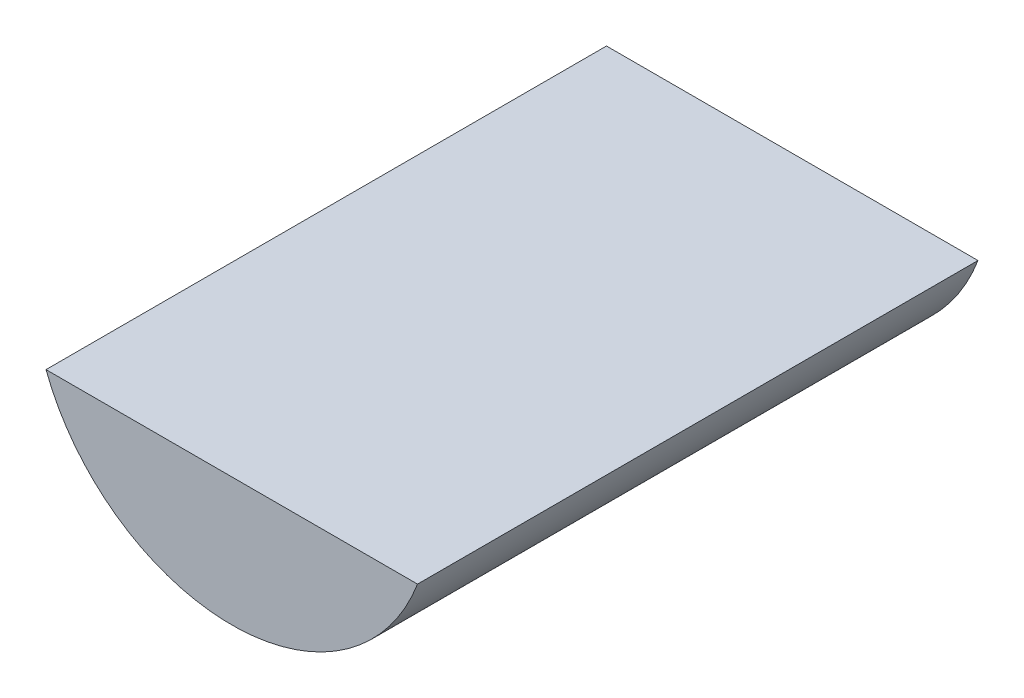
ISO-10303-21;
HEADER;
FILE_DESCRIPTION(('STEP AP214'),'2;1');
FILE_NAME('part.step','',(''),(''),'','','');
FILE_SCHEMA(('AUTOMOTIVE_DESIGN { 1 0 10303 214 1 1 1 1 }'));
ENDSEC;
DATA;
#1=APPLICATION_CONTEXT('core data for automotive mechanical design processes');
#2=APPLICATION_PROTOCOL_DEFINITION('international standard','automotive_design',2000,#1);
#3=PRODUCT_CONTEXT('',#1,'mechanical');
#4=PRODUCT('Part','Part','',(#3));
#5=PRODUCT_RELATED_PRODUCT_CATEGORY('part','',(#4));
#6=PRODUCT_DEFINITION_FORMATION('','',#4);
#7=PRODUCT_DEFINITION_CONTEXT('part definition',#1,'design');
#8=PRODUCT_DEFINITION('design','',#6,#7);
#9=PRODUCT_DEFINITION_SHAPE('','',#8);
#10=(LENGTH_UNIT() NAMED_UNIT(*) SI_UNIT(.MILLI.,.METRE.));
#11=(NAMED_UNIT(*) PLANE_ANGLE_UNIT() SI_UNIT($,.RADIAN.));
#12=(NAMED_UNIT(*) SI_UNIT($,.STERADIAN.) SOLID_ANGLE_UNIT());
#13=UNCERTAINTY_MEASURE_WITH_UNIT(LENGTH_MEASURE(1.E-05),#10,'distance_accuracy_value','');
#14=(GEOMETRIC_REPRESENTATION_CONTEXT(3) GLOBAL_UNCERTAINTY_ASSIGNED_CONTEXT((#13)) GLOBAL_UNIT_ASSIGNED_CONTEXT((#10,
#11,#12)) REPRESENTATION_CONTEXT('',''));
#15=CARTESIAN_POINT('',(0.,0.,0.));
#16=DIRECTION('',(0.,0.,1.));
#17=DIRECTION('',(1.,0.,0.));
#18=AXIS2_PLACEMENT_3D('',#15,#16,#17);
#19=CARTESIAN_POINT('',(-998.41089966679,-1437.01651980748,-5664.2));
#20=DIRECTION('',(0.550722321953465,0.83468851921072,0.));
#21=DIRECTION('',(-0.83468851921072,0.550722321953465,0.));
#22=AXIS2_PLACEMENT_3D('',#19,#20,#21);
#23=PLANE('',#22);
#24=DIRECTION('',(0.,0.,1.));
#25=VECTOR('',#24,1.);
#26=CARTESIAN_POINT('',(-1193.8,-1308.1,-5664.2));
#27=LINE('',#26,#25);
#28=CARTESIAN_POINT('',(-1193.80000000003,-1308.1,-10033.));
#29=VERTEX_POINT('',#28);
#30=CARTESIAN_POINT('',(-1193.8,-1308.1,-8958.58));
#31=VERTEX_POINT('',#30);
#32=EDGE_CURVE('E46',#29,#31,#27,.T.);
#33=ORIENTED_EDGE('',*,*,#32,.T.);
#34=DIRECTION('',(0.83468851921072,-0.550722321953465,0.));
#35=VECTOR('',#34,1.);
#36=CARTESIAN_POINT('',(-998.41089966679,-1437.01651980748,-8958.58));
#37=LINE('',#36,#35);
#38=CARTESIAN_POINT('',(-577.850000000028,-1714.5,-8958.58));
#39=VERTEX_POINT('',#38);
#40=EDGE_CURVE('E297',#31,#39,#37,.T.);
#41=ORIENTED_EDGE('',*,*,#40,.T.);
#42=DIRECTION('',(0.,0.,1.));
#43=VECTOR('',#42,1.);
#44=CARTESIAN_POINT('',(-577.85,-1714.5,-5664.2));
#45=LINE('',#44,#43);
#46=CARTESIAN_POINT('',(-577.850000000028,-1714.5,-10033.));
#47=VERTEX_POINT('',#46);
#48=EDGE_CURVE('E455',#47,#39,#45,.T.);
#49=ORIENTED_EDGE('',*,*,#48,.F.);
#50=DIRECTION('',(-0.83468851921072,0.550722321953465,0.));
#51=VECTOR('',#50,1.);
#52=CARTESIAN_POINT('',(-998.410899666819,-1437.01651980748,-10033.));
#53=LINE('',#52,#51);
#54=EDGE_CURVE('E405',#47,#29,#53,.T.);
#55=ORIENTED_EDGE('',*,*,#54,.T.);
#56=EDGE_LOOP('',(#33,#41,#49,#55));
#57=FACE_BOUND('',#56,.T.);
#58=ADVANCED_FACE('F42',(#57),#23,.T.);
#59=CARTESIAN_POINT('',(3.4404713510362E-13,-1714.5,-5664.2));
#60=DIRECTION('',(0.,1.,0.));
#61=DIRECTION('',(-1.,0.,0.));
#62=AXIS2_PLACEMENT_3D('',#59,#60,#61);
#63=PLANE('',#62);
#64=ORIENTED_EDGE('',*,*,#48,.T.);
#65=DIRECTION('',(1.,0.,0.));
#66=VECTOR('',#65,1.);
#67=CARTESIAN_POINT('',(3.4404713510362E-13,-1714.5,-8958.58));
#68=LINE('',#67,#66);
#69=CARTESIAN_POINT('',(577.849999999972,-1714.50000000002,-8958.58));
#70=VERTEX_POINT('',#69);
#71=EDGE_CURVE('E294',#39,#70,#68,.T.);
#72=ORIENTED_EDGE('',*,*,#71,.T.);
#73=DIRECTION('',(0.,0.,1.));
#74=VECTOR('',#73,1.);
#75=CARTESIAN_POINT('',(577.85,-1714.5,-5664.2));
#76=LINE('',#75,#74);
#77=CARTESIAN_POINT('',(577.849999999972,-1714.5,-10033.));
#78=VERTEX_POINT('',#77);
#79=EDGE_CURVE('E459',#78,#70,#76,.T.);
#80=ORIENTED_EDGE('',*,*,#79,.F.);
#81=DIRECTION('',(-1.,0.,0.));
#82=VECTOR('',#81,1.);
#83=CARTESIAN_POINT('',(-2.81124928215631E-11,-1714.5,-10033.));
#84=LINE('',#83,#82);
#85=EDGE_CURVE('E420',#78,#47,#84,.T.);
#86=ORIENTED_EDGE('',*,*,#85,.T.);
#87=EDGE_LOOP('',(#64,#72,#80,#86));
#88=FACE_BOUND('',#87,.T.);
#89=ADVANCED_FACE('F568',(#88),#63,.T.);
#90=CARTESIAN_POINT('',(998.41089966679,-1437.01651980748,-5664.2));
#91=DIRECTION('',(-0.550722321953465,0.83468851921072,0.));
#92=DIRECTION('',(-0.83468851921072,-0.550722321953465,0.));
#93=AXIS2_PLACEMENT_3D('',#90,#91,#92);
#94=PLANE('',#93);
#95=ORIENTED_EDGE('',*,*,#79,.T.);
#96=DIRECTION('',(0.83468851921072,0.550722321953465,0.));
#97=VECTOR('',#96,1.);
#98=CARTESIAN_POINT('',(998.41089966679,-1437.01651980748,-8958.58));
#99=LINE('',#98,#97);
#100=CARTESIAN_POINT('',(1193.8,-1308.1,-8958.58));
#101=VERTEX_POINT('',#100);
#102=EDGE_CURVE('E291',#70,#101,#99,.T.);
#103=ORIENTED_EDGE('',*,*,#102,.T.);
#104=DIRECTION('',(0.,0.,1.));
#105=VECTOR('',#104,1.);
#106=CARTESIAN_POINT('',(1193.8,-1308.1,-5664.2));
#107=LINE('',#106,#105);
#108=CARTESIAN_POINT('',(1193.79999999997,-1308.1,-10033.));
#109=VERTEX_POINT('',#108);
#110=EDGE_CURVE('E464',#109,#101,#107,.T.);
#111=ORIENTED_EDGE('',*,*,#110,.F.);
#112=DIRECTION('',(-0.83468851921072,-0.550722321953465,0.));
#113=VECTOR('',#112,1.);
#114=CARTESIAN_POINT('',(998.410899666762,-1437.01651980748,-10033.));
#115=LINE('',#114,#113);
#116=EDGE_CURVE('E417',#109,#78,#115,.T.);
#117=ORIENTED_EDGE('',*,*,#116,.T.);
#118=EDGE_LOOP('',(#95,#103,#111,#117));
#119=FACE_BOUND('',#118,.T.);
#120=ADVANCED_FACE('F609',(#119),#94,.T.);
#121=CARTESIAN_POINT('',(1193.8,76.2,-5664.2));
#122=DIRECTION('',(-1.,0.,0.));
#123=DIRECTION('',(0.,0.,1.));
#124=AXIS2_PLACEMENT_3D('',#121,#122,#123);
#125=PLANE('',#124);
#126=ORIENTED_EDGE('',*,*,#110,.T.);
#127=DIRECTION('',(0.,1.,0.));
#128=VECTOR('',#127,1.);
#129=CARTESIAN_POINT('',(1193.8,76.2,-8958.58));
#130=LINE('',#129,#128);
#131=CARTESIAN_POINT('',(1193.8,-685.8,-8958.58));
#132=VERTEX_POINT('',#131);
#133=EDGE_CURVE('E288',#101,#132,#130,.T.);
#134=ORIENTED_EDGE('',*,*,#133,.T.);
#135=DIRECTION('',(0.,0.,1.));
#136=VECTOR('',#135,1.);
#137=CARTESIAN_POINT('',(1193.8,-685.8,-5664.2));
#138=LINE('',#137,#136);
#139=CARTESIAN_POINT('',(1193.79999999997,-685.8,-10033.));
#140=VERTEX_POINT('',#139);
#141=EDGE_CURVE('E469',#140,#132,#138,.T.);
#142=ORIENTED_EDGE('',*,*,#141,.F.);
#143=DIRECTION('',(0.,-1.,0.));
#144=VECTOR('',#143,1.);
#145=CARTESIAN_POINT('',(1193.79999999997,76.2,-10033.));
#146=LINE('',#145,#144);
#147=EDGE_CURVE('E414',#140,#109,#146,.T.);
#148=ORIENTED_EDGE('',*,*,#147,.T.);
#149=EDGE_LOOP('',(#126,#134,#142,#148));
#150=FACE_BOUND('',#149,.T.);
#151=ADVANCED_FACE('F614',(#150),#125,.T.);
#152=CARTESIAN_POINT('',(0.,-685.8,-5664.2));
#153=DIRECTION('',(0.,-1.,0.));
#154=DIRECTION('',(0.,0.,-1.));
#155=AXIS2_PLACEMENT_3D('',#152,#153,#154);
#156=PLANE('',#155);
#157=ORIENTED_EDGE('',*,*,#141,.T.);
#158=DIRECTION('',(-1.,0.,0.));
#159=VECTOR('',#158,1.);
#160=CARTESIAN_POINT('',(0.,-685.8,-8958.58));
#161=LINE('',#160,#159);
#162=CARTESIAN_POINT('',(-1193.8,-685.8,-8958.58));
#163=VERTEX_POINT('',#162);
#164=EDGE_CURVE('E285',#132,#163,#161,.T.);
#165=ORIENTED_EDGE('',*,*,#164,.T.);
#166=DIRECTION('',(0.,0.,1.));
#167=VECTOR('',#166,1.);
#168=CARTESIAN_POINT('',(-1193.8,-685.8,-5664.2));
#169=LINE('',#168,#167);
#170=CARTESIAN_POINT('',(-1193.80000000003,-685.8,-10033.));
#171=VERTEX_POINT('',#170);
#172=EDGE_CURVE('E473',#171,#163,#169,.T.);
#173=ORIENTED_EDGE('',*,*,#172,.F.);
#174=DIRECTION('',(1.,0.,0.));
#175=VECTOR('',#174,1.);
#176=CARTESIAN_POINT('',(-2.84565399566668E-11,-685.8,-10033.));
#177=LINE('',#176,#175);
#178=EDGE_CURVE('E411',#171,#140,#177,.T.);
#179=ORIENTED_EDGE('',*,*,#178,.T.);
#180=EDGE_LOOP('',(#157,#165,#173,#179));
#181=FACE_BOUND('',#180,.T.);
#182=ADVANCED_FACE('F618',(#181),#156,.T.);
#183=CARTESIAN_POINT('',(-1193.8,76.2,-5664.2));
#184=DIRECTION('',(1.,0.,0.));
#185=DIRECTION('',(0.,0.,-1.));
#186=AXIS2_PLACEMENT_3D('',#183,#184,#185);
#187=PLANE('',#186);
#188=ORIENTED_EDGE('',*,*,#172,.T.);
#189=DIRECTION('',(0.,-1.,0.));
#190=VECTOR('',#189,1.);
#191=CARTESIAN_POINT('',(-1193.8,76.2,-8958.58));
#192=LINE('',#191,#190);
#193=EDGE_CURVE('E270',#163,#31,#192,.T.);
#194=ORIENTED_EDGE('',*,*,#193,.T.);
#195=ORIENTED_EDGE('',*,*,#32,.F.);
#196=DIRECTION('',(0.,1.,0.));
#197=VECTOR('',#196,1.);
#198=CARTESIAN_POINT('',(-1193.80000000003,76.2,-10033.));
#199=LINE('',#198,#197);
#200=EDGE_CURVE('E408',#29,#171,#199,.T.);
#201=ORIENTED_EDGE('',*,*,#200,.T.);
#202=EDGE_LOOP('',(#188,#194,#195,#201));
#203=FACE_BOUND('',#202,.T.);
#204=ADVANCED_FACE('F592',(#203),#187,.T.);
#205=CARTESIAN_POINT('',(-2.84565399566668E-11,76.2,-10033.));
#206=DIRECTION('',(0.,0.,1.));
#207=DIRECTION('',(1.,0.,0.));
#208=AXIS2_PLACEMENT_3D('',#205,#206,#207);
#209=PLANE('',#208);
#210=ORIENTED_EDGE('',*,*,#54,.F.);
#211=ORIENTED_EDGE('',*,*,#85,.F.);
#212=ORIENTED_EDGE('',*,*,#116,.F.);
#213=ORIENTED_EDGE('',*,*,#147,.F.);
#214=ORIENTED_EDGE('',*,*,#178,.F.);
#215=ORIENTED_EDGE('',*,*,#200,.F.);
#216=EDGE_LOOP('',(#210,#211,#212,#213,#214,#215));
#217=FACE_BOUND('',#216,.T.);
#218=DIRECTION('',(-1.,0.,0.));
#219=VECTOR('',#218,1.);
#220=CARTESIAN_POINT('',(-2.84565399566668E-11,-609.6,-10033.));
#221=LINE('',#220,#219);
#222=CARTESIAN_POINT('',(1809.90640376786,-609.6,-10033.));
#223=VERTEX_POINT('',#222);
#224=CARTESIAN_POINT('',(-1809.90640376791,-609.6,-10033.));
#225=VERTEX_POINT('',#224);
#226=EDGE_CURVE('E423',#223,#225,#221,.T.);
#227=ORIENTED_EDGE('',*,*,#226,.F.);
#228=CARTESIAN_POINT('',(-2.84565399566668E-11,76.2,-10033.));
#229=DIRECTION('',(0.,0.,1.));
#230=DIRECTION('',(1.,0.,0.));
#231=AXIS2_PLACEMENT_3D('',#228,#229,#230);
#232=CIRCLE('',#231,1935.48);
#233=EDGE_CURVE('E426',#225,#223,#232,.T.);
#234=ORIENTED_EDGE('',*,*,#233,.F.);
#235=EDGE_LOOP('',(#227,#234));
#236=FACE_BOUND('',#235,.T.);
#237=ADVANCED_FACE('F589',(#217,#236),#209,.F.);
#238=CARTESIAN_POINT('',(0.,76.2,-4572.));
#239=DIRECTION('',(0.,0.,1.));
#240=DIRECTION('',(1.,0.,0.));
#241=AXIS2_PLACEMENT_3D('',#238,#239,#240);
#242=PLANE('',#241);
#243=DIRECTION('',(-1.,0.,0.));
#244=VECTOR('',#243,1.);
#245=CARTESIAN_POINT('',(0.,-609.6,-4572.));
#246=LINE('',#245,#244);
#247=CARTESIAN_POINT('',(1809.90640376789,-609.6,-4572.));
#248=VERTEX_POINT('',#247);
#249=CARTESIAN_POINT('',(-1809.90640376789,-609.6,-4572.));
#250=VERTEX_POINT('',#249);
#251=EDGE_CURVE('E447',#248,#250,#246,.T.);
#252=ORIENTED_EDGE('',*,*,#251,.T.);
#253=CARTESIAN_POINT('',(0.,76.2,-4572.));
#254=DIRECTION('',(0.,0.,1.));
#255=DIRECTION('',(1.,0.,0.));
#256=AXIS2_PLACEMENT_3D('',#253,#254,#255);
#257=CIRCLE('',#256,1935.48);
#258=EDGE_CURVE('E450',#250,#248,#257,.T.);
#259=ORIENTED_EDGE('',*,*,#258,.T.);
#260=EDGE_LOOP('',(#252,#259));
#261=FACE_BOUND('',#260,.T.);
#262=ADVANCED_FACE('F591',(#261),#242,.T.);
#263=CARTESIAN_POINT('',(0.,76.2,-5664.2));
#264=DIRECTION('',(0.,0.,1.));
#265=DIRECTION('',(1.,0.,0.));
#266=AXIS2_PLACEMENT_3D('',#263,#264,#265);
#267=CYLINDRICAL_SURFACE('',#266,1935.48);
#268=ORIENTED_EDGE('',*,*,#258,.F.);
#269=DIRECTION('',(0.,0.,1.));
#270=VECTOR('',#269,1.);
#271=CARTESIAN_POINT('',(-1809.90640376789,-609.6,-5664.2));
#272=LINE('',#271,#270);
#273=EDGE_CURVE('E52',#225,#250,#272,.T.);
#274=ORIENTED_EDGE('',*,*,#273,.F.);
#275=ORIENTED_EDGE('',*,*,#233,.T.);
#276=DIRECTION('',(0.,0.,1.));
#277=VECTOR('',#276,1.);
#278=CARTESIAN_POINT('',(1809.90640376789,-609.6,-5664.2));
#279=LINE('',#278,#277);
#280=EDGE_CURVE('E11',#223,#248,#279,.T.);
#281=ORIENTED_EDGE('',*,*,#280,.T.);
#282=EDGE_LOOP('',(#268,#274,#275,#281));
#283=FACE_BOUND('',#282,.T.);
#284=ADVANCED_FACE('F597',(#283),#267,.T.);
#285=CARTESIAN_POINT('',(0.,-609.6,-5664.2));
#286=DIRECTION('',(0.,1.,0.));
#287=DIRECTION('',(0.,0.,1.));
#288=AXIS2_PLACEMENT_3D('',#285,#286,#287);
#289=PLANE('',#288);
#290=ORIENTED_EDGE('',*,*,#251,.F.);
#291=ORIENTED_EDGE('',*,*,#280,.F.);
#292=ORIENTED_EDGE('',*,*,#226,.T.);
#293=ORIENTED_EDGE('',*,*,#273,.T.);
#294=EDGE_LOOP('',(#290,#291,#292,#293));
#295=FACE_BOUND('',#294,.T.);
#296=ADVANCED_FACE('F601',(#295),#289,.T.);
#297=CARTESIAN_POINT('',(-2.84565399566668E-11,76.2,-8958.58));
#298=DIRECTION('',(0.,0.,1.));
#299=DIRECTION('',(1.,0.,0.));
#300=AXIS2_PLACEMENT_3D('',#297,#298,#299);
#301=PLANE('',#300);
#302=ORIENTED_EDGE('',*,*,#40,.F.);
#303=ORIENTED_EDGE('',*,*,#193,.F.);
#304=ORIENTED_EDGE('',*,*,#164,.F.);
#305=ORIENTED_EDGE('',*,*,#133,.F.);
#306=ORIENTED_EDGE('',*,*,#102,.F.);
#307=ORIENTED_EDGE('',*,*,#71,.F.);
#308=EDGE_LOOP('',(#302,#303,#304,#305,#306,#307));
#309=FACE_BOUND('',#308,.T.);
#310=ADVANCED_FACE('F604',(#309),#301,.F.);
#311=CLOSED_SHELL('',(#58,#89,#120,#151,#182,#204,#237,#262,#284,#296,#310));
#312=CARTESIAN_POINT('',(-2.84565399566668E-11,76.2,-8940.8));
#313=DIRECTION('',(0.,0.,1.));
#314=DIRECTION('',(1.,0.,0.));
#315=AXIS2_PLACEMENT_3D('',#312,#313,#314);
#316=PLANE('',#315);
#317=DIRECTION('',(0.,-1.,0.));
#318=VECTOR('',#317,1.);
#319=CARTESIAN_POINT('',(-1193.8,76.2,-8940.8));
#320=LINE('',#319,#318);
#321=CARTESIAN_POINT('',(-1193.8,-685.8,-8940.8));
#322=VERTEX_POINT('',#321);
#323=CARTESIAN_POINT('',(-1193.8,-1308.1,-8940.8));
#324=VERTEX_POINT('',#323);
#325=EDGE_CURVE('E257',#322,#324,#320,.T.);
#326=ORIENTED_EDGE('',*,*,#325,.T.);
#327=DIRECTION('',(0.83468851921072,-0.550722321953465,0.));
#328=VECTOR('',#327,1.);
#329=CARTESIAN_POINT('',(-998.41089966679,-1437.01651980748,-8940.8));
#330=LINE('',#329,#328);
#331=CARTESIAN_POINT('',(-577.85,-1714.5,-8940.8));
#332=VERTEX_POINT('',#331);
#333=EDGE_CURVE('E266',#324,#332,#330,.T.);
#334=ORIENTED_EDGE('',*,*,#333,.T.);
#335=DIRECTION('',(1.,0.,0.));
#336=VECTOR('',#335,1.);
#337=CARTESIAN_POINT('',(3.4404713510362E-13,-1714.5,-8940.8));
#338=LINE('',#337,#336);
#339=CARTESIAN_POINT('',(577.85,-1714.5,-8940.8));
#340=VERTEX_POINT('',#339);
#341=EDGE_CURVE('E60',#332,#340,#338,.T.);
#342=ORIENTED_EDGE('',*,*,#341,.T.);
#343=DIRECTION('',(0.83468851921072,0.550722321953465,0.));
#344=VECTOR('',#343,1.);
#345=CARTESIAN_POINT('',(998.41089966679,-1437.01651980748,-8940.8));
#346=LINE('',#345,#344);
#347=CARTESIAN_POINT('',(1193.8,-1308.1,-8940.8));
#348=VERTEX_POINT('',#347);
#349=EDGE_CURVE('E68',#340,#348,#346,.T.);
#350=ORIENTED_EDGE('',*,*,#349,.T.);
#351=DIRECTION('',(0.,1.,0.));
#352=VECTOR('',#351,1.);
#353=CARTESIAN_POINT('',(1193.8,76.2,-8940.8));
#354=LINE('',#353,#352);
#355=CARTESIAN_POINT('',(1193.8,-685.8,-8940.8));
#356=VERTEX_POINT('',#355);
#357=EDGE_CURVE('E277',#348,#356,#354,.T.);
#358=ORIENTED_EDGE('',*,*,#357,.T.);
#359=DIRECTION('',(-1.,0.,0.));
#360=VECTOR('',#359,1.);
#361=CARTESIAN_POINT('',(0.,-685.8,-8940.8));
#362=LINE('',#361,#360);
#363=EDGE_CURVE('E275',#356,#322,#362,.T.);
#364=ORIENTED_EDGE('',*,*,#363,.T.);
#365=EDGE_LOOP('',(#326,#334,#342,#350,#358,#364));
#366=FACE_BOUND('',#365,.T.);
#367=ADVANCED_FACE('F273',(#366),#316,.T.);
#368=CARTESIAN_POINT('',(-2.13424049675001E-11,76.2,-7866.38));
#369=DIRECTION('',(0.,0.,1.));
#370=DIRECTION('',(1.,0.,0.));
#371=AXIS2_PLACEMENT_3D('',#368,#369,#370);
#372=PLANE('',#371);
#373=DIRECTION('',(0.83468851921072,-0.550722321953465,0.));
#374=VECTOR('',#373,1.);
#375=CARTESIAN_POINT('',(-998.41089966679,-1437.01651980748,-7866.38));
#376=LINE('',#375,#374);
#377=CARTESIAN_POINT('',(-1193.8,-1308.1,-7866.38));
#378=VERTEX_POINT('',#377);
#379=CARTESIAN_POINT('',(-577.850000000028,-1714.5,-7866.38));
#380=VERTEX_POINT('',#379);
#381=EDGE_CURVE('E331',#378,#380,#376,.T.);
#382=ORIENTED_EDGE('',*,*,#381,.F.);
#383=DIRECTION('',(0.,-1.,0.));
#384=VECTOR('',#383,1.);
#385=CARTESIAN_POINT('',(-1193.8,76.2,-7866.38));
#386=LINE('',#385,#384);
#387=CARTESIAN_POINT('',(-1193.8,-685.8,-7866.38));
#388=VERTEX_POINT('',#387);
#389=EDGE_CURVE('E260',#388,#378,#386,.T.);
#390=ORIENTED_EDGE('',*,*,#389,.F.);
#391=DIRECTION('',(-1.,0.,0.));
#392=VECTOR('',#391,1.);
#393=CARTESIAN_POINT('',(0.,-685.8,-7866.38));
#394=LINE('',#393,#392);
#395=CARTESIAN_POINT('',(1193.8,-685.8,-7866.38));
#396=VERTEX_POINT('',#395);
#397=EDGE_CURVE('E319',#396,#388,#394,.T.);
#398=ORIENTED_EDGE('',*,*,#397,.F.);
#399=DIRECTION('',(0.,1.,0.));
#400=VECTOR('',#399,1.);
#401=CARTESIAN_POINT('',(1193.8,76.2,-7866.38));
#402=LINE('',#401,#400);
#403=CARTESIAN_POINT('',(1193.8,-1308.1,-7866.38));
#404=VERTEX_POINT('',#403);
#405=EDGE_CURVE('E322',#404,#396,#402,.T.);
#406=ORIENTED_EDGE('',*,*,#405,.F.);
#407=DIRECTION('',(0.83468851921072,0.550722321953465,0.));
#408=VECTOR('',#407,1.);
#409=CARTESIAN_POINT('',(998.41089966679,-1437.01651980748,-7866.38));
#410=LINE('',#409,#408);
#411=CARTESIAN_POINT('',(577.849999999972,-1714.50000000002,-7866.38));
#412=VERTEX_POINT('',#411);
#413=EDGE_CURVE('E325',#412,#404,#410,.T.);
#414=ORIENTED_EDGE('',*,*,#413,.F.);
#415=DIRECTION('',(1.,0.,0.));
#416=VECTOR('',#415,1.);
#417=CARTESIAN_POINT('',(3.4404713510362E-13,-1714.5,-7866.38));
#418=LINE('',#417,#416);
#419=EDGE_CURVE('E328',#380,#412,#418,.T.);
#420=ORIENTED_EDGE('',*,*,#419,.F.);
#421=EDGE_LOOP('',(#382,#390,#398,#406,#414,#420));
#422=FACE_BOUND('',#421,.T.);
#423=ADVANCED_FACE('F549',(#422),#372,.F.);
#424=ORIENTED_EDGE('',*,*,#325,.F.);
#425=EDGE_CURVE('E475',#322,#388,#169,.T.);
#426=ORIENTED_EDGE('',*,*,#425,.T.);
#427=ORIENTED_EDGE('',*,*,#389,.T.);
#428=EDGE_CURVE('E253',#324,#378,#27,.T.);
#429=ORIENTED_EDGE('',*,*,#428,.F.);
#430=EDGE_LOOP('',(#424,#426,#427,#429));
#431=FACE_BOUND('',#430,.T.);
#432=ADVANCED_FACE('F255',(#431),#187,.T.);
#433=ORIENTED_EDGE('',*,*,#363,.F.);
#434=EDGE_CURVE('E471',#356,#396,#138,.T.);
#435=ORIENTED_EDGE('',*,*,#434,.T.);
#436=ORIENTED_EDGE('',*,*,#397,.T.);
#437=ORIENTED_EDGE('',*,*,#425,.F.);
#438=EDGE_LOOP('',(#433,#435,#436,#437));
#439=FACE_BOUND('',#438,.T.);
#440=ADVANCED_FACE('F680',(#439),#156,.T.);
#441=ORIENTED_EDGE('',*,*,#357,.F.);
#442=EDGE_CURVE('E467',#348,#404,#107,.T.);
#443=ORIENTED_EDGE('',*,*,#442,.T.);
#444=ORIENTED_EDGE('',*,*,#405,.T.);
#445=ORIENTED_EDGE('',*,*,#434,.F.);
#446=EDGE_LOOP('',(#441,#443,#444,#445));
#447=FACE_BOUND('',#446,.T.);
#448=ADVANCED_FACE('F673',(#447),#125,.T.);
#449=ORIENTED_EDGE('',*,*,#349,.F.);
#450=EDGE_CURVE('E462',#340,#412,#76,.T.);
#451=ORIENTED_EDGE('',*,*,#450,.T.);
#452=ORIENTED_EDGE('',*,*,#413,.T.);
#453=ORIENTED_EDGE('',*,*,#442,.F.);
#454=EDGE_LOOP('',(#449,#451,#452,#453));
#455=FACE_BOUND('',#454,.T.);
#456=ADVANCED_FACE('F545',(#455),#94,.T.);
#457=ORIENTED_EDGE('',*,*,#341,.F.);
#458=EDGE_CURVE('E268',#332,#380,#45,.T.);
#459=ORIENTED_EDGE('',*,*,#458,.T.);
#460=ORIENTED_EDGE('',*,*,#419,.T.);
#461=ORIENTED_EDGE('',*,*,#450,.F.);
#462=EDGE_LOOP('',(#457,#459,#460,#461));
#463=FACE_BOUND('',#462,.T.);
#464=ADVANCED_FACE('F551',(#463),#63,.T.);
#465=ORIENTED_EDGE('',*,*,#333,.F.);
#466=ORIENTED_EDGE('',*,*,#428,.T.);
#467=ORIENTED_EDGE('',*,*,#381,.T.);
#468=ORIENTED_EDGE('',*,*,#458,.F.);
#469=EDGE_LOOP('',(#465,#466,#467,#468));
#470=FACE_BOUND('',#469,.T.);
#471=ADVANCED_FACE('F267',(#470),#23,.T.);
#472=CLOSED_SHELL('',(#367,#423,#432,#440,#448,#456,#464,#471));
#473=CARTESIAN_POINT('',(-2.13424049675001E-11,76.2,-7848.6));
#474=DIRECTION('',(0.,0.,1.));
#475=DIRECTION('',(1.,0.,0.));
#476=AXIS2_PLACEMENT_3D('',#473,#474,#475);
#477=PLANE('',#476);
#478=DIRECTION('',(0.,-1.,0.));
#479=VECTOR('',#478,1.);
#480=CARTESIAN_POINT('',(-1193.8,76.2,-7848.6));
#481=LINE('',#480,#479);
#482=CARTESIAN_POINT('',(-1193.8,-685.8,-7848.6));
#483=VERTEX_POINT('',#482);
#484=CARTESIAN_POINT('',(-1193.8,-1308.1,-7848.6));
#485=VERTEX_POINT('',#484);
#486=EDGE_CURVE('E300',#483,#485,#481,.T.);
#487=ORIENTED_EDGE('',*,*,#486,.T.);
#488=DIRECTION('',(0.83468851921072,-0.550722321953465,0.));
#489=VECTOR('',#488,1.);
#490=CARTESIAN_POINT('',(-998.41089966679,-1437.01651980748,-7848.6));
#491=LINE('',#490,#489);
#492=CARTESIAN_POINT('',(-577.85,-1714.5,-7848.6));
#493=VERTEX_POINT('',#492);
#494=EDGE_CURVE('E315',#485,#493,#491,.T.);
#495=ORIENTED_EDGE('',*,*,#494,.T.);
#496=DIRECTION('',(1.,0.,0.));
#497=VECTOR('',#496,1.);
#498=CARTESIAN_POINT('',(3.4404713510362E-13,-1714.5,-7848.6));
#499=LINE('',#498,#497);
#500=CARTESIAN_POINT('',(577.85,-1714.5,-7848.6));
#501=VERTEX_POINT('',#500);
#502=EDGE_CURVE('E312',#493,#501,#499,.T.);
#503=ORIENTED_EDGE('',*,*,#502,.T.);
#504=DIRECTION('',(0.83468851921072,0.550722321953465,0.));
#505=VECTOR('',#504,1.);
#506=CARTESIAN_POINT('',(998.41089966679,-1437.01651980748,-7848.6));
#507=LINE('',#506,#505);
#508=CARTESIAN_POINT('',(1193.8,-1308.1,-7848.6));
#509=VERTEX_POINT('',#508);
#510=EDGE_CURVE('E309',#501,#509,#507,.T.);
#511=ORIENTED_EDGE('',*,*,#510,.T.);
#512=DIRECTION('',(0.,1.,0.));
#513=VECTOR('',#512,1.);
#514=CARTESIAN_POINT('',(1193.8,76.2,-7848.6));
#515=LINE('',#514,#513);
#516=CARTESIAN_POINT('',(1193.8,-685.8,-7848.6));
#517=VERTEX_POINT('',#516);
#518=EDGE_CURVE('E306',#509,#517,#515,.T.);
#519=ORIENTED_EDGE('',*,*,#518,.T.);
#520=DIRECTION('',(-1.,0.,0.));
#521=VECTOR('',#520,1.);
#522=CARTESIAN_POINT('',(0.,-685.8,-7848.6));
#523=LINE('',#522,#521);
#524=EDGE_CURVE('E303',#517,#483,#523,.T.);
#525=ORIENTED_EDGE('',*,*,#524,.T.);
#526=EDGE_LOOP('',(#487,#495,#503,#511,#519,#525));
#527=FACE_BOUND('',#526,.T.);
#528=ADVANCED_FACE('F511',(#527),#477,.T.);
#529=CARTESIAN_POINT('',(-1.42282699783334E-11,76.2,-6774.18));
#530=DIRECTION('',(0.,0.,1.));
#531=DIRECTION('',(1.,0.,0.));
#532=AXIS2_PLACEMENT_3D('',#529,#530,#531);
#533=PLANE('',#532);
#534=DIRECTION('',(0.83468851921072,-0.550722321953465,0.));
#535=VECTOR('',#534,1.);
#536=CARTESIAN_POINT('',(-998.41089966679,-1437.01651980748,-6774.18));
#537=LINE('',#536,#535);
#538=CARTESIAN_POINT('',(-1193.8,-1308.1,-6774.18));
#539=VERTEX_POINT('',#538);
#540=CARTESIAN_POINT('',(-577.850000000028,-1714.5,-6774.18));
#541=VERTEX_POINT('',#540);
#542=EDGE_CURVE('E366',#539,#541,#537,.T.);
#543=ORIENTED_EDGE('',*,*,#542,.F.);
#544=DIRECTION('',(0.,-1.,0.));
#545=VECTOR('',#544,1.);
#546=CARTESIAN_POINT('',(-1193.8,76.2,-6774.18));
#547=LINE('',#546,#545);
#548=CARTESIAN_POINT('',(-1193.8,-685.8,-6774.18));
#549=VERTEX_POINT('',#548);
#550=EDGE_CURVE('E351',#549,#539,#547,.T.);
#551=ORIENTED_EDGE('',*,*,#550,.F.);
#552=DIRECTION('',(-1.,0.,0.));
#553=VECTOR('',#552,1.);
#554=CARTESIAN_POINT('',(0.,-685.8,-6774.18));
#555=LINE('',#554,#553);
#556=CARTESIAN_POINT('',(1193.8,-685.8,-6774.18));
#557=VERTEX_POINT('',#556);
#558=EDGE_CURVE('E354',#557,#549,#555,.T.);
#559=ORIENTED_EDGE('',*,*,#558,.F.);
#560=DIRECTION('',(0.,1.,0.));
#561=VECTOR('',#560,1.);
#562=CARTESIAN_POINT('',(1193.8,76.2,-6774.18));
#563=LINE('',#562,#561);
#564=CARTESIAN_POINT('',(1193.8,-1308.1,-6774.18));
#565=VERTEX_POINT('',#564);
#566=EDGE_CURVE('E357',#565,#557,#563,.T.);
#567=ORIENTED_EDGE('',*,*,#566,.F.);
#568=DIRECTION('',(0.83468851921072,0.550722321953465,0.));
#569=VECTOR('',#568,1.);
#570=CARTESIAN_POINT('',(998.41089966679,-1437.01651980748,-6774.18));
#571=LINE('',#570,#569);
#572=CARTESIAN_POINT('',(577.849999999972,-1714.50000000002,-6774.18));
#573=VERTEX_POINT('',#572);
#574=EDGE_CURVE('E360',#573,#565,#571,.T.);
#575=ORIENTED_EDGE('',*,*,#574,.F.);
#576=DIRECTION('',(1.,0.,0.));
#577=VECTOR('',#576,1.);
#578=CARTESIAN_POINT('',(3.4404713510362E-13,-1714.5,-6774.18));
#579=LINE('',#578,#577);
#580=EDGE_CURVE('E363',#541,#573,#579,.T.);
#581=ORIENTED_EDGE('',*,*,#580,.F.);
#582=EDGE_LOOP('',(#543,#551,#559,#567,#575,#581));
#583=FACE_BOUND('',#582,.T.);
#584=ADVANCED_FACE('F502',(#583),#533,.F.);
#585=ORIENTED_EDGE('',*,*,#486,.F.);
#586=EDGE_CURVE('E479',#483,#549,#169,.T.);
#587=ORIENTED_EDGE('',*,*,#586,.T.);
#588=ORIENTED_EDGE('',*,*,#550,.T.);
#589=EDGE_CURVE('E264',#485,#539,#27,.T.);
#590=ORIENTED_EDGE('',*,*,#589,.F.);
#591=EDGE_LOOP('',(#585,#587,#588,#590));
#592=FACE_BOUND('',#591,.T.);
#593=ADVANCED_FACE('F505',(#592),#187,.T.);
#594=ORIENTED_EDGE('',*,*,#524,.F.);
#595=EDGE_CURVE('E517',#517,#557,#138,.T.);
#596=ORIENTED_EDGE('',*,*,#595,.T.);
#597=ORIENTED_EDGE('',*,*,#558,.T.);
#598=ORIENTED_EDGE('',*,*,#586,.F.);
#599=EDGE_LOOP('',(#594,#596,#597,#598));
#600=FACE_BOUND('',#599,.T.);
#601=ADVANCED_FACE('F508',(#600),#156,.T.);
#602=ORIENTED_EDGE('',*,*,#518,.F.);
#603=EDGE_CURVE('E515',#509,#565,#107,.T.);
#604=ORIENTED_EDGE('',*,*,#603,.T.);
#605=ORIENTED_EDGE('',*,*,#566,.T.);
#606=ORIENTED_EDGE('',*,*,#595,.F.);
#607=EDGE_LOOP('',(#602,#604,#605,#606));
#608=FACE_BOUND('',#607,.T.);
#609=ADVANCED_FACE('F514',(#608),#125,.T.);
#610=ORIENTED_EDGE('',*,*,#510,.F.);
#611=EDGE_CURVE('E540',#501,#573,#76,.T.);
#612=ORIENTED_EDGE('',*,*,#611,.T.);
#613=ORIENTED_EDGE('',*,*,#574,.T.);
#614=ORIENTED_EDGE('',*,*,#603,.F.);
#615=EDGE_LOOP('',(#610,#612,#613,#614));
#616=FACE_BOUND('',#615,.T.);
#617=ADVANCED_FACE('F519',(#616),#94,.T.);
#618=ORIENTED_EDGE('',*,*,#502,.F.);
#619=EDGE_CURVE('E552',#493,#541,#45,.T.);
#620=ORIENTED_EDGE('',*,*,#619,.T.);
#621=ORIENTED_EDGE('',*,*,#580,.T.);
#622=ORIENTED_EDGE('',*,*,#611,.F.);
#623=EDGE_LOOP('',(#618,#620,#621,#622));
#624=FACE_BOUND('',#623,.T.);
#625=ADVANCED_FACE('F679',(#624),#63,.T.);
#626=ORIENTED_EDGE('',*,*,#494,.F.);
#627=ORIENTED_EDGE('',*,*,#589,.T.);
#628=ORIENTED_EDGE('',*,*,#542,.T.);
#629=ORIENTED_EDGE('',*,*,#619,.F.);
#630=EDGE_LOOP('',(#626,#627,#628,#629));
#631=FACE_BOUND('',#630,.T.);
#632=ADVANCED_FACE('F496',(#631),#23,.T.);
#633=CLOSED_SHELL('',(#528,#584,#593,#601,#609,#617,#625,#632));
#634=CARTESIAN_POINT('',(-1.42282699783334E-11,76.2,-6756.4));
#635=DIRECTION('',(0.,0.,1.));
#636=DIRECTION('',(1.,0.,0.));
#637=AXIS2_PLACEMENT_3D('',#634,#635,#636);
#638=PLANE('',#637);
#639=DIRECTION('',(0.,-1.,0.));
#640=VECTOR('',#639,1.);
#641=CARTESIAN_POINT('',(-1193.8,76.2,-6756.4));
#642=LINE('',#641,#640);
#643=CARTESIAN_POINT('',(-1193.8,-685.8,-6756.4));
#644=VERTEX_POINT('',#643);
#645=CARTESIAN_POINT('',(-1193.8,-1308.1,-6756.4));
#646=VERTEX_POINT('',#645);
#647=EDGE_CURVE('E333',#644,#646,#642,.T.);
#648=ORIENTED_EDGE('',*,*,#647,.T.);
#649=DIRECTION('',(0.83468851921072,-0.550722321953465,0.));
#650=VECTOR('',#649,1.);
#651=CARTESIAN_POINT('',(-998.41089966679,-1437.01651980748,-6756.4));
#652=LINE('',#651,#650);
#653=CARTESIAN_POINT('',(-577.85,-1714.5,-6756.4));
#654=VERTEX_POINT('',#653);
#655=EDGE_CURVE('E348',#646,#654,#652,.T.);
#656=ORIENTED_EDGE('',*,*,#655,.T.);
#657=DIRECTION('',(1.,0.,0.));
#658=VECTOR('',#657,1.);
#659=CARTESIAN_POINT('',(3.4404713510362E-13,-1714.5,-6756.4));
#660=LINE('',#659,#658);
#661=CARTESIAN_POINT('',(577.85,-1714.5,-6756.4));
#662=VERTEX_POINT('',#661);
#663=EDGE_CURVE('E345',#654,#662,#660,.T.);
#664=ORIENTED_EDGE('',*,*,#663,.T.);
#665=DIRECTION('',(0.83468851921072,0.550722321953465,0.));
#666=VECTOR('',#665,1.);
#667=CARTESIAN_POINT('',(998.41089966679,-1437.01651980748,-6756.4));
#668=LINE('',#667,#666);
#669=CARTESIAN_POINT('',(1193.8,-1308.1,-6756.4));
#670=VERTEX_POINT('',#669);
#671=EDGE_CURVE('E342',#662,#670,#668,.T.);
#672=ORIENTED_EDGE('',*,*,#671,.T.);
#673=DIRECTION('',(0.,1.,0.));
#674=VECTOR('',#673,1.);
#675=CARTESIAN_POINT('',(1193.8,76.2,-6756.4));
#676=LINE('',#675,#674);
#677=CARTESIAN_POINT('',(1193.8,-685.8,-6756.4));
#678=VERTEX_POINT('',#677);
#679=EDGE_CURVE('E339',#670,#678,#676,.T.);
#680=ORIENTED_EDGE('',*,*,#679,.T.);
#681=DIRECTION('',(-1.,0.,0.));
#682=VECTOR('',#681,1.);
#683=CARTESIAN_POINT('',(0.,-685.8,-6756.4));
#684=LINE('',#683,#682);
#685=EDGE_CURVE('E336',#678,#644,#684,.T.);
#686=ORIENTED_EDGE('',*,*,#685,.T.);
#687=EDGE_LOOP('',(#648,#656,#664,#672,#680,#686));
#688=FACE_BOUND('',#687,.T.);
#689=ADVANCED_FACE('F632',(#688),#638,.T.);
#690=CARTESIAN_POINT('',(-7.11413498916669E-12,76.2,-5681.98));
#691=DIRECTION('',(0.,0.,1.));
#692=DIRECTION('',(1.,0.,0.));
#693=AXIS2_PLACEMENT_3D('',#690,#691,#692);
#694=PLANE('',#693);
#695=DIRECTION('',(0.83468851921072,-0.550722321953465,0.));
#696=VECTOR('',#695,1.);
#697=CARTESIAN_POINT('',(-998.41089966679,-1437.01651980748,-5681.98));
#698=LINE('',#697,#696);
#699=CARTESIAN_POINT('',(-1193.8,-1308.1,-5681.98));
#700=VERTEX_POINT('',#699);
#701=CARTESIAN_POINT('',(-577.850000000028,-1714.5,-5681.98));
#702=VERTEX_POINT('',#701);
#703=EDGE_CURVE('E402',#700,#702,#698,.T.);
#704=ORIENTED_EDGE('',*,*,#703,.F.);
#705=DIRECTION('',(0.,-1.,0.));
#706=VECTOR('',#705,1.);
#707=CARTESIAN_POINT('',(-1193.8,76.2,-5681.98));
#708=LINE('',#707,#706);
#709=CARTESIAN_POINT('',(-1193.8,-685.8,-5681.98));
#710=VERTEX_POINT('',#709);
#711=EDGE_CURVE('E387',#710,#700,#708,.T.);
#712=ORIENTED_EDGE('',*,*,#711,.F.);
#713=DIRECTION('',(-1.,0.,0.));
#714=VECTOR('',#713,1.);
#715=CARTESIAN_POINT('',(0.,-685.8,-5681.98));
#716=LINE('',#715,#714);
#717=CARTESIAN_POINT('',(1193.8,-685.8,-5681.98));
#718=VERTEX_POINT('',#717);
#719=EDGE_CURVE('E390',#718,#710,#716,.T.);
#720=ORIENTED_EDGE('',*,*,#719,.F.);
#721=DIRECTION('',(0.,1.,0.));
#722=VECTOR('',#721,1.);
#723=CARTESIAN_POINT('',(1193.8,76.2,-5681.98));
#724=LINE('',#723,#722);
#725=CARTESIAN_POINT('',(1193.8,-1308.1,-5681.98));
#726=VERTEX_POINT('',#725);
#727=EDGE_CURVE('E393',#726,#718,#724,.T.);
#728=ORIENTED_EDGE('',*,*,#727,.F.);
#729=DIRECTION('',(0.83468851921072,0.550722321953465,0.));
#730=VECTOR('',#729,1.);
#731=CARTESIAN_POINT('',(998.41089966679,-1437.01651980748,-5681.98));
#732=LINE('',#731,#730);
#733=CARTESIAN_POINT('',(577.849999999972,-1714.50000000002,-5681.98));
#734=VERTEX_POINT('',#733);
#735=EDGE_CURVE('E396',#734,#726,#732,.T.);
#736=ORIENTED_EDGE('',*,*,#735,.F.);
#737=DIRECTION('',(1.,0.,0.));
#738=VECTOR('',#737,1.);
#739=CARTESIAN_POINT('',(3.4404713510362E-13,-1714.5,-5681.98));
#740=LINE('',#739,#738);
#741=EDGE_CURVE('E399',#702,#734,#740,.T.);
#742=ORIENTED_EDGE('',*,*,#741,.F.);
#743=EDGE_LOOP('',(#704,#712,#720,#728,#736,#742));
#744=FACE_BOUND('',#743,.T.);
#745=ADVANCED_FACE('F587',(#744),#694,.F.);
#746=ORIENTED_EDGE('',*,*,#647,.F.);
#747=EDGE_CURVE('E480',#644,#710,#169,.T.);
#748=ORIENTED_EDGE('',*,*,#747,.T.);
#749=ORIENTED_EDGE('',*,*,#711,.T.);
#750=EDGE_CURVE('E486',#646,#700,#27,.T.);
#751=ORIENTED_EDGE('',*,*,#750,.F.);
#752=EDGE_LOOP('',(#746,#748,#749,#751));
#753=FACE_BOUND('',#752,.T.);
#754=ADVANCED_FACE('F621',(#753),#187,.T.);
#755=ORIENTED_EDGE('',*,*,#685,.F.);
#756=EDGE_CURVE('E478',#678,#718,#138,.T.);
#757=ORIENTED_EDGE('',*,*,#756,.T.);
#758=ORIENTED_EDGE('',*,*,#719,.T.);
#759=ORIENTED_EDGE('',*,*,#747,.F.);
#760=EDGE_LOOP('',(#755,#757,#758,#759));
#761=FACE_BOUND('',#760,.T.);
#762=ADVANCED_FACE('F619',(#761),#156,.T.);
#763=ORIENTED_EDGE('',*,*,#679,.F.);
#764=EDGE_CURVE('E521',#670,#726,#107,.T.);
#765=ORIENTED_EDGE('',*,*,#764,.T.);
#766=ORIENTED_EDGE('',*,*,#727,.T.);
#767=ORIENTED_EDGE('',*,*,#756,.F.);
#768=EDGE_LOOP('',(#763,#765,#766,#767));
#769=FACE_BOUND('',#768,.T.);
#770=ADVANCED_FACE('F615',(#769),#125,.T.);
#771=ORIENTED_EDGE('',*,*,#671,.F.);
#772=EDGE_CURVE('E539',#662,#734,#76,.T.);
#773=ORIENTED_EDGE('',*,*,#772,.T.);
#774=ORIENTED_EDGE('',*,*,#735,.T.);
#775=ORIENTED_EDGE('',*,*,#764,.F.);
#776=EDGE_LOOP('',(#771,#773,#774,#775));
#777=FACE_BOUND('',#776,.T.);
#778=ADVANCED_FACE('F610',(#777),#94,.T.);
#779=ORIENTED_EDGE('',*,*,#663,.F.);
#780=EDGE_CURVE('E553',#654,#702,#45,.T.);
#781=ORIENTED_EDGE('',*,*,#780,.T.);
#782=ORIENTED_EDGE('',*,*,#741,.T.);
#783=ORIENTED_EDGE('',*,*,#772,.F.);
#784=EDGE_LOOP('',(#779,#781,#782,#783));
#785=FACE_BOUND('',#784,.T.);
#786=ADVANCED_FACE('F569',(#785),#63,.T.);
#787=ORIENTED_EDGE('',*,*,#655,.F.);
#788=ORIENTED_EDGE('',*,*,#750,.T.);
#789=ORIENTED_EDGE('',*,*,#703,.T.);
#790=ORIENTED_EDGE('',*,*,#780,.F.);
#791=EDGE_LOOP('',(#787,#788,#789,#790));
#792=FACE_BOUND('',#791,.T.);
#793=ADVANCED_FACE('F562',(#792),#23,.T.);
#794=CLOSED_SHELL('',(#689,#745,#754,#762,#770,#778,#786,#793));
#795=CARTESIAN_POINT('',(-7.11413498916669E-12,76.2,-5664.2));
#796=DIRECTION('',(0.,0.,1.));
#797=DIRECTION('',(1.,0.,0.));
#798=AXIS2_PLACEMENT_3D('',#795,#796,#797);
#799=PLANE('',#798);
#800=DIRECTION('',(0.,-1.,0.));
#801=VECTOR('',#800,1.);
#802=CARTESIAN_POINT('',(-1193.8,76.2,-5664.2));
#803=LINE('',#802,#801);
#804=CARTESIAN_POINT('',(-1193.8,-685.8,-5664.2));
#805=VERTEX_POINT('',#804);
#806=CARTESIAN_POINT('',(-1193.8,-1308.1,-5664.2));
#807=VERTEX_POINT('',#806);
#808=EDGE_CURVE('E369',#805,#807,#803,.T.);
#809=ORIENTED_EDGE('',*,*,#808,.T.);
#810=DIRECTION('',(0.83468851921072,-0.550722321953465,0.));
#811=VECTOR('',#810,1.);
#812=CARTESIAN_POINT('',(-998.41089966679,-1437.01651980748,-5664.2));
#813=LINE('',#812,#811);
#814=CARTESIAN_POINT('',(-577.85,-1714.5,-5664.2));
#815=VERTEX_POINT('',#814);
#816=EDGE_CURVE('E384',#807,#815,#813,.T.);
#817=ORIENTED_EDGE('',*,*,#816,.T.);
#818=DIRECTION('',(1.,0.,0.));
#819=VECTOR('',#818,1.);
#820=CARTESIAN_POINT('',(3.4404713510362E-13,-1714.5,-5664.2));
#821=LINE('',#820,#819);
#822=CARTESIAN_POINT('',(577.85,-1714.5,-5664.2));
#823=VERTEX_POINT('',#822);
#824=EDGE_CURVE('E381',#815,#823,#821,.T.);
#825=ORIENTED_EDGE('',*,*,#824,.T.);
#826=DIRECTION('',(0.83468851921072,0.550722321953465,0.));
#827=VECTOR('',#826,1.);
#828=CARTESIAN_POINT('',(998.41089966679,-1437.01651980748,-5664.2));
#829=LINE('',#828,#827);
#830=CARTESIAN_POINT('',(1193.8,-1308.1,-5664.2));
#831=VERTEX_POINT('',#830);
#832=EDGE_CURVE('E378',#823,#831,#829,.T.);
#833=ORIENTED_EDGE('',*,*,#832,.T.);
#834=DIRECTION('',(0.,1.,0.));
#835=VECTOR('',#834,1.);
#836=CARTESIAN_POINT('',(1193.8,76.2,-5664.2));
#837=LINE('',#836,#835);
#838=CARTESIAN_POINT('',(1193.8,-685.8,-5664.2));
#839=VERTEX_POINT('',#838);
#840=EDGE_CURVE('E375',#831,#839,#837,.T.);
#841=ORIENTED_EDGE('',*,*,#840,.T.);
#842=DIRECTION('',(-1.,0.,0.));
#843=VECTOR('',#842,1.);
#844=CARTESIAN_POINT('',(0.,-685.8,-5664.2));
#845=LINE('',#844,#843);
#846=EDGE_CURVE('E372',#839,#805,#845,.T.);
#847=ORIENTED_EDGE('',*,*,#846,.T.);
#848=EDGE_LOOP('',(#809,#817,#825,#833,#841,#847));
#849=FACE_BOUND('',#848,.T.);
#850=ADVANCED_FACE('F570',(#849),#799,.T.);
#851=CARTESIAN_POINT('',(0.,76.2,-4589.78));
#852=DIRECTION('',(0.,0.,1.));
#853=DIRECTION('',(1.,0.,0.));
#854=AXIS2_PLACEMENT_3D('',#851,#852,#853);
#855=PLANE('',#854);
#856=DIRECTION('',(0.83468851921072,-0.550722321953465,0.));
#857=VECTOR('',#856,1.);
#858=CARTESIAN_POINT('',(-998.41089966679,-1437.01651980748,-4589.78));
#859=LINE('',#858,#857);
#860=CARTESIAN_POINT('',(-1193.8,-1308.1,-4589.78));
#861=VERTEX_POINT('',#860);
#862=CARTESIAN_POINT('',(-577.85,-1714.5,-4589.78));
#863=VERTEX_POINT('',#862);
#864=EDGE_CURVE('E444',#861,#863,#859,.T.);
#865=ORIENTED_EDGE('',*,*,#864,.F.);
#866=DIRECTION('',(0.,-1.,0.));
#867=VECTOR('',#866,1.);
#868=CARTESIAN_POINT('',(-1193.8,76.2,-4589.78));
#869=LINE('',#868,#867);
#870=CARTESIAN_POINT('',(-1193.8,-685.8,-4589.78));
#871=VERTEX_POINT('',#870);
#872=EDGE_CURVE('E429',#871,#861,#869,.T.);
#873=ORIENTED_EDGE('',*,*,#872,.F.);
#874=DIRECTION('',(-1.,0.,0.));
#875=VECTOR('',#874,1.);
#876=CARTESIAN_POINT('',(0.,-685.8,-4589.78));
#877=LINE('',#876,#875);
#878=CARTESIAN_POINT('',(1193.8,-685.8,-4589.78));
#879=VERTEX_POINT('',#878);
#880=EDGE_CURVE('E432',#879,#871,#877,.T.);
#881=ORIENTED_EDGE('',*,*,#880,.F.);
#882=DIRECTION('',(0.,1.,0.));
#883=VECTOR('',#882,1.);
#884=CARTESIAN_POINT('',(1193.8,76.2,-4589.78));
#885=LINE('',#884,#883);
#886=CARTESIAN_POINT('',(1193.8,-1308.1,-4589.78));
#887=VERTEX_POINT('',#886);
#888=EDGE_CURVE('E435',#887,#879,#885,.T.);
#889=ORIENTED_EDGE('',*,*,#888,.F.);
#890=DIRECTION('',(0.83468851921072,0.550722321953465,0.));
#891=VECTOR('',#890,1.);
#892=CARTESIAN_POINT('',(998.41089966679,-1437.01651980748,-4589.78));
#893=LINE('',#892,#891);
#894=CARTESIAN_POINT('',(577.85,-1714.5,-4589.78));
#895=VERTEX_POINT('',#894);
#896=EDGE_CURVE('E438',#895,#887,#893,.T.);
#897=ORIENTED_EDGE('',*,*,#896,.F.);
#898=DIRECTION('',(1.,0.,0.));
#899=VECTOR('',#898,1.);
#900=CARTESIAN_POINT('',(3.4404713510362E-13,-1714.5,-4589.78));
#901=LINE('',#900,#899);
#902=EDGE_CURVE('E441',#863,#895,#901,.T.);
#903=ORIENTED_EDGE('',*,*,#902,.F.);
#904=EDGE_LOOP('',(#865,#873,#881,#889,#897,#903));
#905=FACE_BOUND('',#904,.T.);
#906=ADVANCED_FACE('F534',(#905),#855,.F.);
#907=ORIENTED_EDGE('',*,*,#808,.F.);
#908=EDGE_CURVE('E476',#805,#871,#169,.T.);
#909=ORIENTED_EDGE('',*,*,#908,.T.);
#910=ORIENTED_EDGE('',*,*,#872,.T.);
#911=EDGE_CURVE('E452',#807,#861,#27,.T.);
#912=ORIENTED_EDGE('',*,*,#911,.F.);
#913=EDGE_LOOP('',(#907,#909,#910,#912));
#914=FACE_BOUND('',#913,.T.);
#915=ADVANCED_FACE('F583',(#914),#187,.T.);
#916=ORIENTED_EDGE('',*,*,#846,.F.);
#917=EDGE_CURVE('E472',#839,#879,#138,.T.);
#918=ORIENTED_EDGE('',*,*,#917,.T.);
#919=ORIENTED_EDGE('',*,*,#880,.T.);
#920=ORIENTED_EDGE('',*,*,#908,.F.);
#921=EDGE_LOOP('',(#916,#918,#919,#920));
#922=FACE_BOUND('',#921,.T.);
#923=ADVANCED_FACE('F613',(#922),#156,.T.);
#924=ORIENTED_EDGE('',*,*,#840,.F.);
#925=EDGE_CURVE('E468',#831,#887,#107,.T.);
#926=ORIENTED_EDGE('',*,*,#925,.T.);
#927=ORIENTED_EDGE('',*,*,#888,.T.);
#928=ORIENTED_EDGE('',*,*,#917,.F.);
#929=EDGE_LOOP('',(#924,#926,#927,#928));
#930=FACE_BOUND('',#929,.T.);
#931=ADVANCED_FACE('F528',(#930),#125,.T.);
#932=ORIENTED_EDGE('',*,*,#832,.F.);
#933=EDGE_CURVE('E463',#823,#895,#76,.T.);
#934=ORIENTED_EDGE('',*,*,#933,.T.);
#935=ORIENTED_EDGE('',*,*,#896,.T.);
#936=ORIENTED_EDGE('',*,*,#925,.F.);
#937=EDGE_LOOP('',(#932,#934,#935,#936));
#938=FACE_BOUND('',#937,.T.);
#939=ADVANCED_FACE('F536',(#938),#94,.T.);
#940=ORIENTED_EDGE('',*,*,#824,.F.);
#941=EDGE_CURVE('E458',#815,#863,#45,.T.);
#942=ORIENTED_EDGE('',*,*,#941,.T.);
#943=ORIENTED_EDGE('',*,*,#902,.T.);
#944=ORIENTED_EDGE('',*,*,#933,.F.);
#945=EDGE_LOOP('',(#940,#942,#943,#944));
#946=FACE_BOUND('',#945,.T.);
#947=ADVANCED_FACE('F559',(#946),#63,.T.);
#948=ORIENTED_EDGE('',*,*,#816,.F.);
#949=ORIENTED_EDGE('',*,*,#911,.T.);
#950=ORIENTED_EDGE('',*,*,#864,.T.);
#951=ORIENTED_EDGE('',*,*,#941,.F.);
#952=EDGE_LOOP('',(#948,#949,#950,#951));
#953=FACE_BOUND('',#952,.T.);
#954=ADVANCED_FACE('F44',(#953),#23,.T.);
#955=CLOSED_SHELL('',(#850,#906,#915,#923,#931,#939,#947,#954));
#956=ORIENTED_CLOSED_SHELL('',*,#472,.T.);
#957=ORIENTED_CLOSED_SHELL('',*,#633,.T.);
#958=ORIENTED_CLOSED_SHELL('',*,#794,.T.);
#959=ORIENTED_CLOSED_SHELL('',*,#955,.T.);
#960=BREP_WITH_VOIDS('B2',#311,(#956,#957,#958,#959));
#961=ADVANCED_BREP_SHAPE_REPRESENTATION('',(#18,#960),#14);
#962=SHAPE_DEFINITION_REPRESENTATION(#9,#961);
ENDSEC;
END-ISO-10303-21;
